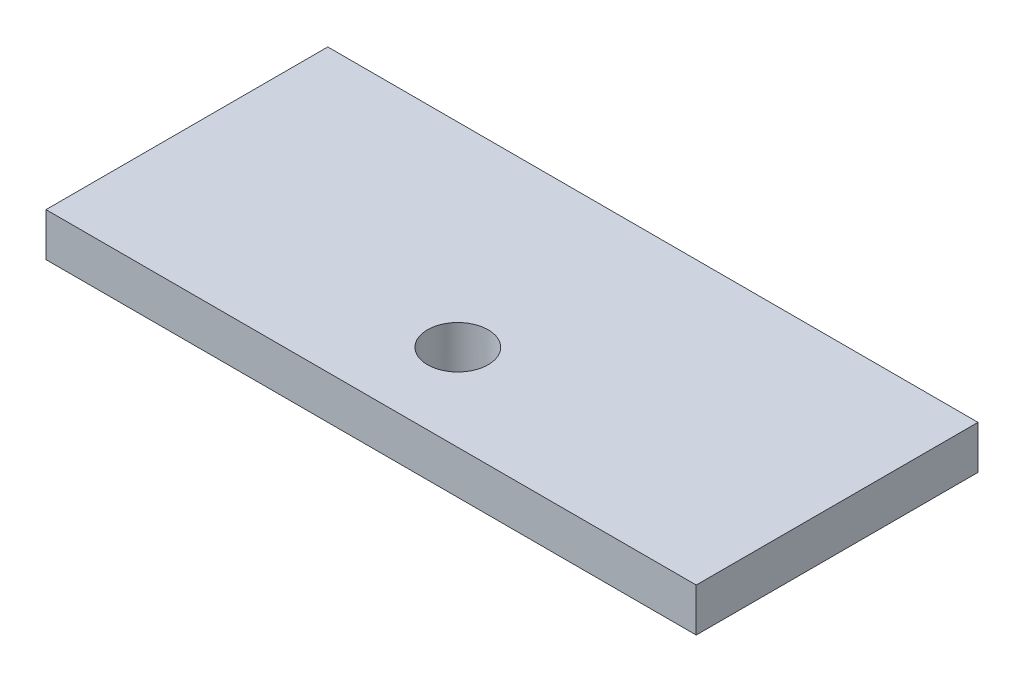
ISO-10303-21;
HEADER;
FILE_DESCRIPTION(('STEP AP214'),'2;1');
FILE_NAME('part.step','',(''),(''),'','','');
FILE_SCHEMA(('AUTOMOTIVE_DESIGN { 1 0 10303 214 1 1 1 1 }'));
ENDSEC;
DATA;
#1=APPLICATION_CONTEXT('core data for automotive mechanical design processes');
#2=APPLICATION_PROTOCOL_DEFINITION('international standard','automotive_design',2000,#1);
#3=PRODUCT_CONTEXT('',#1,'mechanical');
#4=PRODUCT('Part','Part','',(#3));
#5=PRODUCT_RELATED_PRODUCT_CATEGORY('part','',(#4));
#6=PRODUCT_DEFINITION_FORMATION('','',#4);
#7=PRODUCT_DEFINITION_CONTEXT('part definition',#1,'design');
#8=PRODUCT_DEFINITION('design','',#6,#7);
#9=PRODUCT_DEFINITION_SHAPE('','',#8);
#10=(LENGTH_UNIT() NAMED_UNIT(*) SI_UNIT(.MILLI.,.METRE.));
#11=(NAMED_UNIT(*) PLANE_ANGLE_UNIT() SI_UNIT($,.RADIAN.));
#12=(NAMED_UNIT(*) SI_UNIT($,.STERADIAN.) SOLID_ANGLE_UNIT());
#13=UNCERTAINTY_MEASURE_WITH_UNIT(LENGTH_MEASURE(1.E-05),#10,'distance_accuracy_value','');
#14=(GEOMETRIC_REPRESENTATION_CONTEXT(3) GLOBAL_UNCERTAINTY_ASSIGNED_CONTEXT((#13)) GLOBAL_UNIT_ASSIGNED_CONTEXT((#10,
#11,#12)) REPRESENTATION_CONTEXT('',''));
#15=CARTESIAN_POINT('',(0.,0.,0.));
#16=DIRECTION('',(0.,0.,1.));
#17=DIRECTION('',(1.,0.,0.));
#18=AXIS2_PLACEMENT_3D('',#15,#16,#17);
#19=CARTESIAN_POINT('',(75.,10.,32.5));
#20=DIRECTION('',(-1.,0.,0.));
#21=DIRECTION('',(0.,0.,1.));
#22=AXIS2_PLACEMENT_3D('',#19,#20,#21);
#23=PLANE('',#22);
#24=DIRECTION('',(0.,0.,-1.));
#25=VECTOR('',#24,1.);
#26=CARTESIAN_POINT('',(75.,0.,32.5));
#27=LINE('',#26,#25);
#28=CARTESIAN_POINT('',(75.,0.,32.5));
#29=VERTEX_POINT('',#28);
#30=CARTESIAN_POINT('',(75.,0.,-32.5));
#31=VERTEX_POINT('',#30);
#32=EDGE_CURVE('E104',#29,#31,#27,.T.);
#33=ORIENTED_EDGE('',*,*,#32,.T.);
#34=DIRECTION('',(0.,-1.,0.));
#35=VECTOR('',#34,1.);
#36=CARTESIAN_POINT('',(75.,10.,-32.5));
#37=LINE('',#36,#35);
#38=CARTESIAN_POINT('',(75.,10.,-32.5));
#39=VERTEX_POINT('',#38);
#40=EDGE_CURVE('E11',#39,#31,#37,.T.);
#41=ORIENTED_EDGE('',*,*,#40,.F.);
#42=DIRECTION('',(0.,0.,-1.));
#43=VECTOR('',#42,1.);
#44=CARTESIAN_POINT('',(75.,10.,32.5));
#45=LINE('',#44,#43);
#46=CARTESIAN_POINT('',(75.,10.,32.5));
#47=VERTEX_POINT('',#46);
#48=EDGE_CURVE('E91',#47,#39,#45,.T.);
#49=ORIENTED_EDGE('',*,*,#48,.F.);
#50=DIRECTION('',(0.,-1.,0.));
#51=VECTOR('',#50,1.);
#52=CARTESIAN_POINT('',(75.,10.,32.5));
#53=LINE('',#52,#51);
#54=EDGE_CURVE('E100',#47,#29,#53,.T.);
#55=ORIENTED_EDGE('',*,*,#54,.T.);
#56=EDGE_LOOP('',(#33,#41,#49,#55));
#57=FACE_BOUND('',#56,.T.);
#58=ADVANCED_FACE('F39',(#57),#23,.F.);
#59=CARTESIAN_POINT('',(-75.,10.,-32.5));
#60=DIRECTION('',(0.,0.,1.));
#61=DIRECTION('',(1.,0.,0.));
#62=AXIS2_PLACEMENT_3D('',#59,#60,#61);
#63=PLANE('',#62);
#64=DIRECTION('',(-1.,0.,0.));
#65=VECTOR('',#64,1.);
#66=CARTESIAN_POINT('',(-75.,0.,-32.5));
#67=LINE('',#66,#65);
#68=CARTESIAN_POINT('',(-75.,0.,-32.5));
#69=VERTEX_POINT('',#68);
#70=EDGE_CURVE('E95',#31,#69,#67,.T.);
#71=ORIENTED_EDGE('',*,*,#70,.T.);
#72=DIRECTION('',(0.,-1.,0.));
#73=VECTOR('',#72,1.);
#74=CARTESIAN_POINT('',(-75.,10.,-32.5));
#75=LINE('',#74,#73);
#76=CARTESIAN_POINT('',(-75.,10.,-32.5));
#77=VERTEX_POINT('',#76);
#78=EDGE_CURVE('E48',#77,#69,#75,.T.);
#79=ORIENTED_EDGE('',*,*,#78,.F.);
#80=DIRECTION('',(-1.,0.,0.));
#81=VECTOR('',#80,1.);
#82=CARTESIAN_POINT('',(-75.,10.,-32.5));
#83=LINE('',#82,#81);
#84=EDGE_CURVE('E86',#39,#77,#83,.T.);
#85=ORIENTED_EDGE('',*,*,#84,.F.);
#86=ORIENTED_EDGE('',*,*,#40,.T.);
#87=EDGE_LOOP('',(#71,#79,#85,#86));
#88=FACE_BOUND('',#87,.T.);
#89=ADVANCED_FACE('F94',(#88),#63,.F.);
#90=CARTESIAN_POINT('',(-75.,10.,32.5));
#91=DIRECTION('',(1.,0.,0.));
#92=DIRECTION('',(0.,0.,-1.));
#93=AXIS2_PLACEMENT_3D('',#90,#91,#92);
#94=PLANE('',#93);
#95=DIRECTION('',(0.,0.,1.));
#96=VECTOR('',#95,1.);
#97=CARTESIAN_POINT('',(-75.,0.,32.5));
#98=LINE('',#97,#96);
#99=CARTESIAN_POINT('',(-75.,0.,32.5));
#100=VERTEX_POINT('',#99);
#101=EDGE_CURVE('E73',#69,#100,#98,.T.);
#102=ORIENTED_EDGE('',*,*,#101,.T.);
#103=DIRECTION('',(0.,-1.,0.));
#104=VECTOR('',#103,1.);
#105=CARTESIAN_POINT('',(-75.,10.,32.5));
#106=LINE('',#105,#104);
#107=CARTESIAN_POINT('',(-75.,10.,32.5));
#108=VERTEX_POINT('',#107);
#109=EDGE_CURVE('E96',#108,#100,#106,.T.);
#110=ORIENTED_EDGE('',*,*,#109,.F.);
#111=DIRECTION('',(0.,0.,1.));
#112=VECTOR('',#111,1.);
#113=CARTESIAN_POINT('',(-75.,10.,32.5));
#114=LINE('',#113,#112);
#115=EDGE_CURVE('E89',#77,#108,#114,.T.);
#116=ORIENTED_EDGE('',*,*,#115,.F.);
#117=ORIENTED_EDGE('',*,*,#78,.T.);
#118=EDGE_LOOP('',(#102,#110,#116,#117));
#119=FACE_BOUND('',#118,.T.);
#120=ADVANCED_FACE('F98',(#119),#94,.F.);
#121=CARTESIAN_POINT('',(-75.,10.,32.5));
#122=DIRECTION('',(0.,0.,-1.));
#123=DIRECTION('',(-1.,0.,0.));
#124=AXIS2_PLACEMENT_3D('',#121,#122,#123);
#125=PLANE('',#124);
#126=DIRECTION('',(1.,0.,0.));
#127=VECTOR('',#126,1.);
#128=CARTESIAN_POINT('',(-75.,0.,32.5));
#129=LINE('',#128,#127);
#130=EDGE_CURVE('E79',#100,#29,#129,.T.);
#131=ORIENTED_EDGE('',*,*,#130,.T.);
#132=ORIENTED_EDGE('',*,*,#54,.F.);
#133=DIRECTION('',(1.,0.,0.));
#134=VECTOR('',#133,1.);
#135=CARTESIAN_POINT('',(-75.,10.,32.5));
#136=LINE('',#135,#134);
#137=EDGE_CURVE('E56',#108,#47,#136,.T.);
#138=ORIENTED_EDGE('',*,*,#137,.F.);
#139=ORIENTED_EDGE('',*,*,#109,.T.);
#140=EDGE_LOOP('',(#131,#132,#138,#139));
#141=FACE_BOUND('',#140,.T.);
#142=ADVANCED_FACE('F111',(#141),#125,.F.);
#143=CARTESIAN_POINT('',(0.,10.,0.));
#144=DIRECTION('',(0.,-1.,0.));
#145=DIRECTION('',(0.,0.,-1.));
#146=AXIS2_PLACEMENT_3D('',#143,#144,#145);
#147=PLANE('',#146);
#148=CARTESIAN_POINT('',(0.,10.,12.5));
#149=DIRECTION('',(0.,1.,0.));
#150=DIRECTION('',(0.,0.,1.));
#151=AXIS2_PLACEMENT_3D('',#148,#149,#150);
#152=CIRCLE('',#151,7.);
#153=CARTESIAN_POINT('',(0.,10.,19.5));
#154=VERTEX_POINT('',#153);
#155=EDGE_CURVE('E117',#154,#154,#152,.T.);
#156=ORIENTED_EDGE('',*,*,#155,.F.);
#157=EDGE_LOOP('',(#156));
#158=FACE_BOUND('',#157,.T.);
#159=ORIENTED_EDGE('',*,*,#48,.T.);
#160=ORIENTED_EDGE('',*,*,#84,.T.);
#161=ORIENTED_EDGE('',*,*,#115,.T.);
#162=ORIENTED_EDGE('',*,*,#137,.T.);
#163=EDGE_LOOP('',(#159,#160,#161,#162));
#164=FACE_BOUND('',#163,.T.);
#165=ADVANCED_FACE('F87',(#158,#164),#147,.F.);
#166=CARTESIAN_POINT('',(0.,0.,0.));
#167=DIRECTION('',(0.,-1.,0.));
#168=DIRECTION('',(0.,0.,-1.));
#169=AXIS2_PLACEMENT_3D('',#166,#167,#168);
#170=PLANE('',#169);
#171=CARTESIAN_POINT('',(0.,0.,12.5));
#172=DIRECTION('',(0.,-1.,0.));
#173=DIRECTION('',(0.,0.,-1.));
#174=AXIS2_PLACEMENT_3D('',#171,#172,#173);
#175=CIRCLE('',#174,7.);
#176=CARTESIAN_POINT('',(0.,0.,5.5));
#177=VERTEX_POINT('',#176);
#178=EDGE_CURVE('E42',#177,#177,#175,.T.);
#179=ORIENTED_EDGE('',*,*,#178,.F.);
#180=EDGE_LOOP('',(#179));
#181=FACE_BOUND('',#180,.T.);
#182=ORIENTED_EDGE('',*,*,#32,.F.);
#183=ORIENTED_EDGE('',*,*,#130,.F.);
#184=ORIENTED_EDGE('',*,*,#101,.F.);
#185=ORIENTED_EDGE('',*,*,#70,.F.);
#186=EDGE_LOOP('',(#182,#183,#184,#185));
#187=FACE_BOUND('',#186,.T.);
#188=ADVANCED_FACE('F114',(#181,#187),#170,.T.);
#189=CARTESIAN_POINT('',(0.,-1.2E-05,12.5));
#190=DIRECTION('',(0.,1.,0.));
#191=DIRECTION('',(0.,0.,1.));
#192=AXIS2_PLACEMENT_3D('',#189,#190,#191);
#193=CYLINDRICAL_SURFACE('',#192,7.);
#194=ORIENTED_EDGE('',*,*,#178,.T.);
#195=EDGE_LOOP('',(#194));
#196=FACE_BOUND('',#195,.T.);
#197=ORIENTED_EDGE('',*,*,#155,.T.);
#198=EDGE_LOOP('',(#197));
#199=FACE_BOUND('',#198,.T.);
#200=ADVANCED_FACE('F124',(#196,#199),#193,.F.);
#201=CLOSED_SHELL('',(#58,#89,#120,#142,#165,#188,#200));
#202=MANIFOLD_SOLID_BREP('B2',#201);
#203=ADVANCED_BREP_SHAPE_REPRESENTATION('',(#18,#202),#14);
#204=SHAPE_DEFINITION_REPRESENTATION(#9,#203);
ENDSEC;
END-ISO-10303-21;
